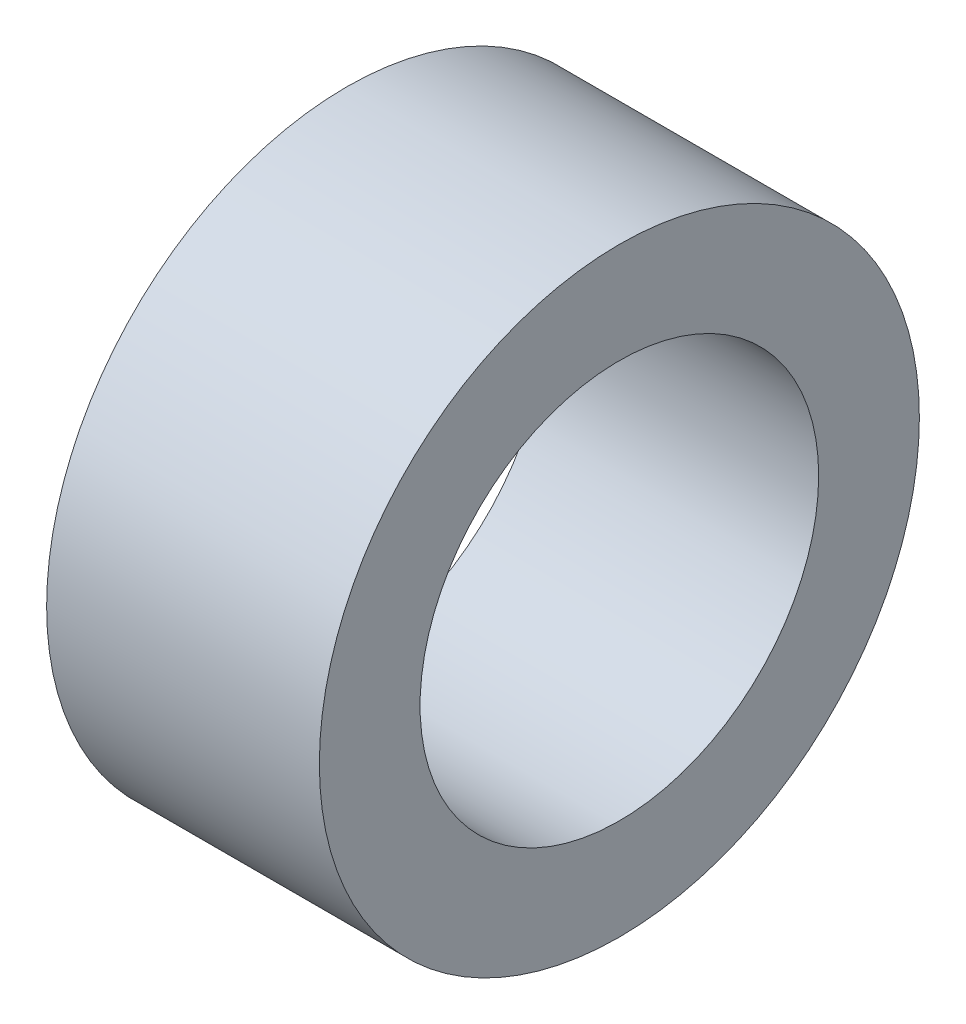
ISO-10303-21;
HEADER;
FILE_DESCRIPTION(('STEP AP214'),'2;1');
FILE_NAME('part.step','',(''),(''),'','','');
FILE_SCHEMA(('AUTOMOTIVE_DESIGN { 1 0 10303 214 1 1 1 1 }'));
ENDSEC;
DATA;
#1=APPLICATION_CONTEXT('core data for automotive mechanical design processes');
#2=APPLICATION_PROTOCOL_DEFINITION('international standard','automotive_design',2000,#1);
#3=PRODUCT_CONTEXT('',#1,'mechanical');
#4=PRODUCT('Part','Part','',(#3));
#5=PRODUCT_RELATED_PRODUCT_CATEGORY('part','',(#4));
#6=PRODUCT_DEFINITION_FORMATION('','',#4);
#7=PRODUCT_DEFINITION_CONTEXT('part definition',#1,'design');
#8=PRODUCT_DEFINITION('design','',#6,#7);
#9=PRODUCT_DEFINITION_SHAPE('','',#8);
#10=(LENGTH_UNIT() NAMED_UNIT(*) SI_UNIT(.MILLI.,.METRE.));
#11=(NAMED_UNIT(*) PLANE_ANGLE_UNIT() SI_UNIT($,.RADIAN.));
#12=(NAMED_UNIT(*) SI_UNIT($,.STERADIAN.) SOLID_ANGLE_UNIT());
#13=UNCERTAINTY_MEASURE_WITH_UNIT(LENGTH_MEASURE(1.E-05),#10,'distance_accuracy_value','');
#14=(GEOMETRIC_REPRESENTATION_CONTEXT(3) GLOBAL_UNCERTAINTY_ASSIGNED_CONTEXT((#13)) GLOBAL_UNIT_ASSIGNED_CONTEXT((#10,
#11,#12)) REPRESENTATION_CONTEXT('',''));
#15=CARTESIAN_POINT('',(0.,0.,0.));
#16=DIRECTION('',(0.,0.,1.));
#17=DIRECTION('',(1.,0.,0.));
#18=AXIS2_PLACEMENT_3D('',#15,#16,#17);
#19=CARTESIAN_POINT('',(0.,0.,0.));
#20=DIRECTION('',(1.,0.,0.));
#21=DIRECTION('',(0.,0.,-1.));
#22=AXIS2_PLACEMENT_3D('',#19,#20,#21);
#23=PLANE('',#22);
#24=CARTESIAN_POINT('',(0.,0.,0.));
#25=DIRECTION('',(1.,0.,0.));
#26=DIRECTION('',(0.,0.,-1.));
#27=AXIS2_PLACEMENT_3D('',#24,#25,#26);
#28=CIRCLE('',#27,9.5);
#29=CARTESIAN_POINT('',(0.,0.,-9.5));
#30=VERTEX_POINT('',#29);
#31=EDGE_CURVE('E41',#30,#30,#28,.T.);
#32=ORIENTED_EDGE('',*,*,#31,.T.);
#33=EDGE_LOOP('',(#32));
#34=FACE_BOUND('',#33,.T.);
#35=CARTESIAN_POINT('',(0.,0.,0.));
#36=DIRECTION('',(-1.,0.,0.));
#37=DIRECTION('',(0.,0.,1.));
#38=AXIS2_PLACEMENT_3D('',#35,#36,#37);
#39=CIRCLE('',#38,14.3);
#40=CARTESIAN_POINT('',(0.,0.,14.3));
#41=VERTEX_POINT('',#40);
#42=EDGE_CURVE('E10',#41,#41,#39,.T.);
#43=ORIENTED_EDGE('',*,*,#42,.T.);
#44=EDGE_LOOP('',(#43));
#45=FACE_BOUND('',#44,.T.);
#46=ADVANCED_FACE('F31',(#34,#45),#23,.F.);
#47=CARTESIAN_POINT('',(-11.341386335533,0.,0.));
#48=DIRECTION('',(-1.,0.,0.));
#49=DIRECTION('',(0.,0.,1.));
#50=AXIS2_PLACEMENT_3D('',#47,#48,#49);
#51=CYLINDRICAL_SURFACE('',#50,14.3);
#52=ORIENTED_EDGE('',*,*,#42,.F.);
#53=EDGE_LOOP('',(#52));
#54=FACE_BOUND('',#53,.T.);
#55=CARTESIAN_POINT('',(13.,0.,0.));
#56=DIRECTION('',(-1.,0.,0.));
#57=DIRECTION('',(0.,0.,1.));
#58=AXIS2_PLACEMENT_3D('',#55,#56,#57);
#59=CIRCLE('',#58,14.3);
#60=CARTESIAN_POINT('',(13.,0.,14.3));
#61=VERTEX_POINT('',#60);
#62=EDGE_CURVE('E37',#61,#61,#59,.T.);
#63=ORIENTED_EDGE('',*,*,#62,.T.);
#64=EDGE_LOOP('',(#63));
#65=FACE_BOUND('',#64,.T.);
#66=ADVANCED_FACE('F56',(#54,#65),#51,.T.);
#67=CARTESIAN_POINT('',(13.,0.,0.));
#68=DIRECTION('',(-1.,0.,0.));
#69=DIRECTION('',(0.,0.,1.));
#70=AXIS2_PLACEMENT_3D('',#67,#68,#69);
#71=PLANE('',#70);
#72=CARTESIAN_POINT('',(13.,0.,0.));
#73=DIRECTION('',(1.,0.,0.));
#74=DIRECTION('',(0.,0.,-1.));
#75=AXIS2_PLACEMENT_3D('',#72,#73,#74);
#76=CIRCLE('',#75,9.5);
#77=CARTESIAN_POINT('',(13.,0.,-9.5));
#78=VERTEX_POINT('',#77);
#79=EDGE_CURVE('E45',#78,#78,#76,.T.);
#80=ORIENTED_EDGE('',*,*,#79,.F.);
#81=EDGE_LOOP('',(#80));
#82=FACE_BOUND('',#81,.T.);
#83=ORIENTED_EDGE('',*,*,#62,.F.);
#84=EDGE_LOOP('',(#83));
#85=FACE_BOUND('',#84,.T.);
#86=ADVANCED_FACE('F53',(#82,#85),#71,.F.);
#87=CARTESIAN_POINT('',(0.,0.,0.));
#88=DIRECTION('',(1.,0.,0.));
#89=DIRECTION('',(0.,0.,-1.));
#90=AXIS2_PLACEMENT_3D('',#87,#88,#89);
#91=CYLINDRICAL_SURFACE('',#90,9.5);
#92=ORIENTED_EDGE('',*,*,#31,.F.);
#93=EDGE_LOOP('',(#92));
#94=FACE_BOUND('',#93,.T.);
#95=ORIENTED_EDGE('',*,*,#79,.T.);
#96=EDGE_LOOP('',(#95));
#97=FACE_BOUND('',#96,.T.);
#98=ADVANCED_FACE('F51',(#94,#97),#91,.F.);
#99=CLOSED_SHELL('',(#46,#66,#86,#98));
#100=MANIFOLD_SOLID_BREP('B2',#99);
#101=ADVANCED_BREP_SHAPE_REPRESENTATION('',(#18,#100),#14);
#102=SHAPE_DEFINITION_REPRESENTATION(#9,#101);
ENDSEC;
END-ISO-10303-21;
